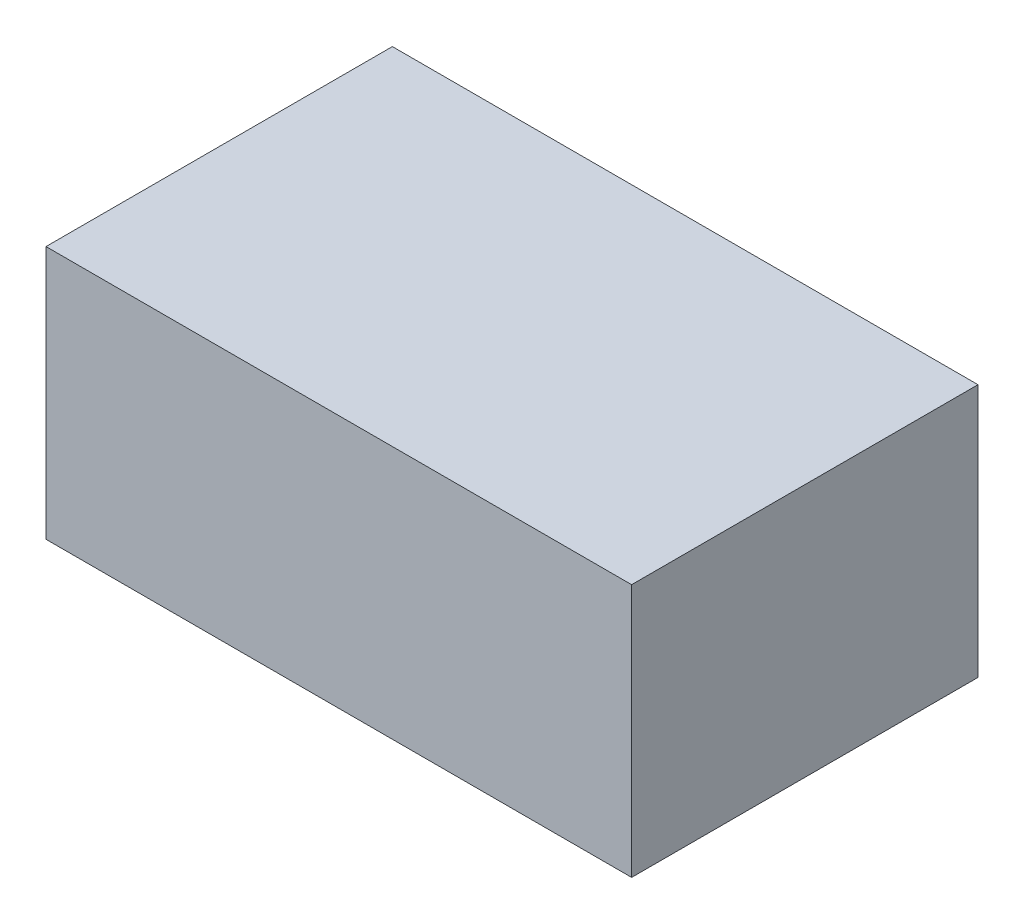
ISO-10303-21;
HEADER;
FILE_DESCRIPTION(('STEP AP214'),'2;1');
FILE_NAME('part.step','',(''),(''),'','','');
FILE_SCHEMA(('AUTOMOTIVE_DESIGN { 1 0 10303 214 1 1 1 1 }'));
ENDSEC;
DATA;
#1=APPLICATION_CONTEXT('core data for automotive mechanical design processes');
#2=APPLICATION_PROTOCOL_DEFINITION('international standard','automotive_design',2000,#1);
#3=PRODUCT_CONTEXT('',#1,'mechanical');
#4=PRODUCT('Part','Part','',(#3));
#5=PRODUCT_RELATED_PRODUCT_CATEGORY('part','',(#4));
#6=PRODUCT_DEFINITION_FORMATION('','',#4);
#7=PRODUCT_DEFINITION_CONTEXT('part definition',#1,'design');
#8=PRODUCT_DEFINITION('design','',#6,#7);
#9=PRODUCT_DEFINITION_SHAPE('','',#8);
#10=(LENGTH_UNIT() NAMED_UNIT(*) SI_UNIT(.MILLI.,.METRE.));
#11=(NAMED_UNIT(*) PLANE_ANGLE_UNIT() SI_UNIT($,.RADIAN.));
#12=(NAMED_UNIT(*) SI_UNIT($,.STERADIAN.) SOLID_ANGLE_UNIT());
#13=UNCERTAINTY_MEASURE_WITH_UNIT(LENGTH_MEASURE(1.E-05),#10,'distance_accuracy_value','');
#14=(GEOMETRIC_REPRESENTATION_CONTEXT(3) GLOBAL_UNCERTAINTY_ASSIGNED_CONTEXT((#13)) GLOBAL_UNIT_ASSIGNED_CONTEXT((#10,
#11,#12)) REPRESENTATION_CONTEXT('',''));
#15=CARTESIAN_POINT('',(0.,0.,0.));
#16=DIRECTION('',(0.,0.,1.));
#17=DIRECTION('',(1.,0.,0.));
#18=AXIS2_PLACEMENT_3D('',#15,#16,#17);
#19=CARTESIAN_POINT('',(0.,426.,0.));
#20=DIRECTION('',(1.,0.,0.));
#21=DIRECTION('',(0.,0.,-1.));
#22=AXIS2_PLACEMENT_3D('',#19,#20,#21);
#23=PLANE('',#22);
#24=DIRECTION('',(0.,0.,1.));
#25=VECTOR('',#24,1.);
#26=CARTESIAN_POINT('',(0.,0.,0.));
#27=LINE('',#26,#25);
#28=CARTESIAN_POINT('',(0.,0.,-582.));
#29=VERTEX_POINT('',#28);
#30=CARTESIAN_POINT('',(0.,0.,0.));
#31=VERTEX_POINT('',#30);
#32=EDGE_CURVE('E75',#29,#31,#27,.T.);
#33=ORIENTED_EDGE('',*,*,#32,.T.);
#34=DIRECTION('',(0.,-1.,0.));
#35=VECTOR('',#34,1.);
#36=CARTESIAN_POINT('',(0.,426.,0.));
#37=LINE('',#36,#35);
#38=CARTESIAN_POINT('',(0.,426.,0.));
#39=VERTEX_POINT('',#38);
#40=EDGE_CURVE('E11',#39,#31,#37,.T.);
#41=ORIENTED_EDGE('',*,*,#40,.F.);
#42=DIRECTION('',(0.,0.,1.));
#43=VECTOR('',#42,1.);
#44=CARTESIAN_POINT('',(0.,426.,0.));
#45=LINE('',#44,#43);
#46=CARTESIAN_POINT('',(0.,426.,-582.));
#47=VERTEX_POINT('',#46);
#48=EDGE_CURVE('E93',#47,#39,#45,.T.);
#49=ORIENTED_EDGE('',*,*,#48,.F.);
#50=DIRECTION('',(0.,-1.,0.));
#51=VECTOR('',#50,1.);
#52=CARTESIAN_POINT('',(0.,426.,-582.));
#53=LINE('',#52,#51);
#54=EDGE_CURVE('E87',#47,#29,#53,.T.);
#55=ORIENTED_EDGE('',*,*,#54,.T.);
#56=EDGE_LOOP('',(#33,#41,#49,#55));
#57=FACE_BOUND('',#56,.T.);
#58=ADVANCED_FACE('F31',(#57),#23,.F.);
#59=CARTESIAN_POINT('',(0.,426.,0.));
#60=DIRECTION('',(0.,0.,-1.));
#61=DIRECTION('',(-1.,0.,0.));
#62=AXIS2_PLACEMENT_3D('',#59,#60,#61);
#63=PLANE('',#62);
#64=DIRECTION('',(1.,0.,0.));
#65=VECTOR('',#64,1.);
#66=CARTESIAN_POINT('',(0.,0.,0.));
#67=LINE('',#66,#65);
#68=CARTESIAN_POINT('',(984.,0.,0.));
#69=VERTEX_POINT('',#68);
#70=EDGE_CURVE('E71',#31,#69,#67,.T.);
#71=ORIENTED_EDGE('',*,*,#70,.T.);
#72=DIRECTION('',(0.,-1.,0.));
#73=VECTOR('',#72,1.);
#74=CARTESIAN_POINT('',(984.,426.,0.));
#75=LINE('',#74,#73);
#76=CARTESIAN_POINT('',(984.,426.,0.));
#77=VERTEX_POINT('',#76);
#78=EDGE_CURVE('E38',#77,#69,#75,.T.);
#79=ORIENTED_EDGE('',*,*,#78,.F.);
#80=DIRECTION('',(1.,0.,0.));
#81=VECTOR('',#80,1.);
#82=CARTESIAN_POINT('',(0.,426.,0.));
#83=LINE('',#82,#81);
#84=EDGE_CURVE('E83',#39,#77,#83,.T.);
#85=ORIENTED_EDGE('',*,*,#84,.F.);
#86=ORIENTED_EDGE('',*,*,#40,.T.);
#87=EDGE_LOOP('',(#71,#79,#85,#86));
#88=FACE_BOUND('',#87,.T.);
#89=ADVANCED_FACE('F82',(#88),#63,.F.);
#90=CARTESIAN_POINT('',(984.,426.,0.));
#91=DIRECTION('',(-1.,0.,0.));
#92=DIRECTION('',(0.,0.,1.));
#93=AXIS2_PLACEMENT_3D('',#90,#91,#92);
#94=PLANE('',#93);
#95=DIRECTION('',(0.,0.,-1.));
#96=VECTOR('',#95,1.);
#97=CARTESIAN_POINT('',(984.,0.,0.));
#98=LINE('',#97,#96);
#99=CARTESIAN_POINT('',(984.,0.,-582.));
#100=VERTEX_POINT('',#99);
#101=EDGE_CURVE('E76',#69,#100,#98,.T.);
#102=ORIENTED_EDGE('',*,*,#101,.T.);
#103=DIRECTION('',(0.,-1.,0.));
#104=VECTOR('',#103,1.);
#105=CARTESIAN_POINT('',(984.,426.,-582.));
#106=LINE('',#105,#104);
#107=CARTESIAN_POINT('',(984.,426.,-582.));
#108=VERTEX_POINT('',#107);
#109=EDGE_CURVE('E99',#108,#100,#106,.T.);
#110=ORIENTED_EDGE('',*,*,#109,.F.);
#111=DIRECTION('',(0.,0.,-1.));
#112=VECTOR('',#111,1.);
#113=CARTESIAN_POINT('',(984.,426.,0.));
#114=LINE('',#113,#112);
#115=EDGE_CURVE('E50',#77,#108,#114,.T.);
#116=ORIENTED_EDGE('',*,*,#115,.F.);
#117=ORIENTED_EDGE('',*,*,#78,.T.);
#118=EDGE_LOOP('',(#102,#110,#116,#117));
#119=FACE_BOUND('',#118,.T.);
#120=ADVANCED_FACE('F102',(#119),#94,.F.);
#121=CARTESIAN_POINT('',(0.,426.,-582.));
#122=DIRECTION('',(0.,0.,1.));
#123=DIRECTION('',(1.,0.,0.));
#124=AXIS2_PLACEMENT_3D('',#121,#122,#123);
#125=PLANE('',#124);
#126=DIRECTION('',(-1.,0.,0.));
#127=VECTOR('',#126,1.);
#128=CARTESIAN_POINT('',(0.,0.,-582.));
#129=LINE('',#128,#127);
#130=EDGE_CURVE('E91',#100,#29,#129,.T.);
#131=ORIENTED_EDGE('',*,*,#130,.T.);
#132=ORIENTED_EDGE('',*,*,#54,.F.);
#133=DIRECTION('',(-1.,0.,0.));
#134=VECTOR('',#133,1.);
#135=CARTESIAN_POINT('',(0.,426.,-582.));
#136=LINE('',#135,#134);
#137=EDGE_CURVE('E45',#108,#47,#136,.T.);
#138=ORIENTED_EDGE('',*,*,#137,.F.);
#139=ORIENTED_EDGE('',*,*,#109,.T.);
#140=EDGE_LOOP('',(#131,#132,#138,#139));
#141=FACE_BOUND('',#140,.T.);
#142=ADVANCED_FACE('F104',(#141),#125,.F.);
#143=CARTESIAN_POINT('',(0.,426.,-582.));
#144=DIRECTION('',(0.,-1.,0.));
#145=DIRECTION('',(0.,0.,-1.));
#146=AXIS2_PLACEMENT_3D('',#143,#144,#145);
#147=PLANE('',#146);
#148=ORIENTED_EDGE('',*,*,#48,.T.);
#149=ORIENTED_EDGE('',*,*,#84,.T.);
#150=ORIENTED_EDGE('',*,*,#115,.T.);
#151=ORIENTED_EDGE('',*,*,#137,.T.);
#152=EDGE_LOOP('',(#148,#149,#150,#151));
#153=FACE_BOUND('',#152,.T.);
#154=ADVANCED_FACE('F105',(#153),#147,.F.);
#155=CARTESIAN_POINT('',(0.,0.,-582.));
#156=DIRECTION('',(0.,-1.,0.));
#157=DIRECTION('',(0.,0.,-1.));
#158=AXIS2_PLACEMENT_3D('',#155,#156,#157);
#159=PLANE('',#158);
#160=ORIENTED_EDGE('',*,*,#32,.F.);
#161=ORIENTED_EDGE('',*,*,#130,.F.);
#162=ORIENTED_EDGE('',*,*,#101,.F.);
#163=ORIENTED_EDGE('',*,*,#70,.F.);
#164=EDGE_LOOP('',(#160,#161,#162,#163));
#165=FACE_BOUND('',#164,.T.);
#166=ADVANCED_FACE('F72',(#165),#159,.T.);
#167=CLOSED_SHELL('',(#58,#89,#120,#142,#154,#166));
#168=MANIFOLD_SOLID_BREP('B2',#167);
#169=ADVANCED_BREP_SHAPE_REPRESENTATION('',(#18,#168),#14);
#170=SHAPE_DEFINITION_REPRESENTATION(#9,#169);
ENDSEC;
END-ISO-10303-21;
